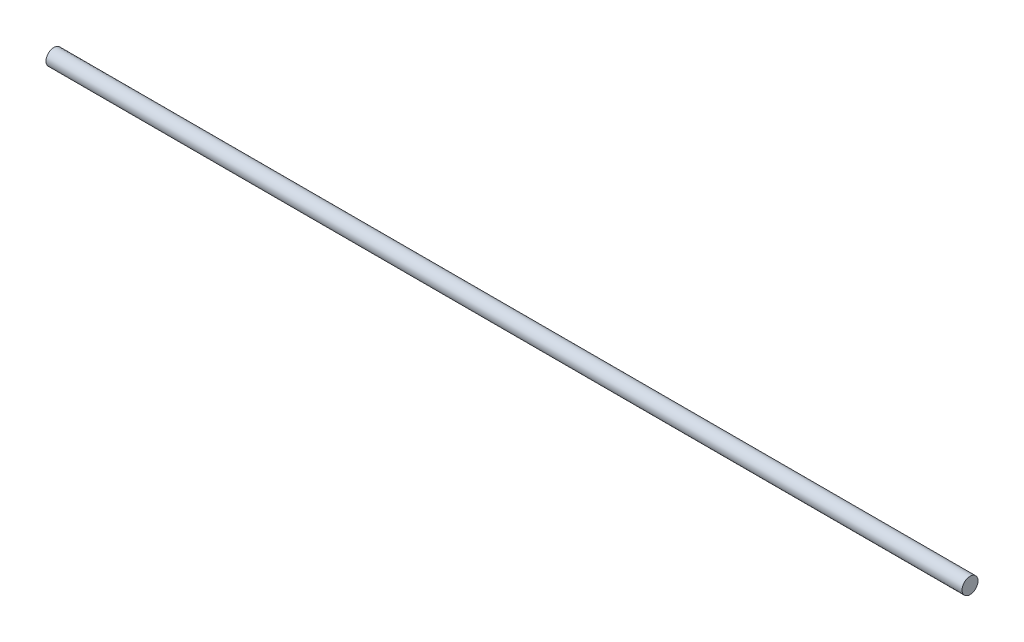
ISO-10303-21;
HEADER;
FILE_DESCRIPTION(('STEP AP214'),'2;1');
FILE_NAME('part.step','',(''),(''),'','','');
FILE_SCHEMA(('AUTOMOTIVE_DESIGN { 1 0 10303 214 1 1 1 1 }'));
ENDSEC;
DATA;
#1=APPLICATION_CONTEXT('core data for automotive mechanical design processes');
#2=APPLICATION_PROTOCOL_DEFINITION('international standard','automotive_design',2000,#1);
#3=PRODUCT_CONTEXT('',#1,'mechanical');
#4=PRODUCT('Part','Part','',(#3));
#5=PRODUCT_RELATED_PRODUCT_CATEGORY('part','',(#4));
#6=PRODUCT_DEFINITION_FORMATION('','',#4);
#7=PRODUCT_DEFINITION_CONTEXT('part definition',#1,'design');
#8=PRODUCT_DEFINITION('design','',#6,#7);
#9=PRODUCT_DEFINITION_SHAPE('','',#8);
#10=(LENGTH_UNIT() NAMED_UNIT(*) SI_UNIT(.MILLI.,.METRE.));
#11=(NAMED_UNIT(*) PLANE_ANGLE_UNIT() SI_UNIT($,.RADIAN.));
#12=(NAMED_UNIT(*) SI_UNIT($,.STERADIAN.) SOLID_ANGLE_UNIT());
#13=UNCERTAINTY_MEASURE_WITH_UNIT(LENGTH_MEASURE(1.E-05),#10,'distance_accuracy_value','');
#14=(GEOMETRIC_REPRESENTATION_CONTEXT(3) GLOBAL_UNCERTAINTY_ASSIGNED_CONTEXT((#13)) GLOBAL_UNIT_ASSIGNED_CONTEXT((#10,
#11,#12)) REPRESENTATION_CONTEXT('',''));
#15=CARTESIAN_POINT('',(0.,0.,0.));
#16=DIRECTION('',(0.,0.,1.));
#17=DIRECTION('',(1.,0.,0.));
#18=AXIS2_PLACEMENT_3D('',#15,#16,#17);
#19=CARTESIAN_POINT('',(460.,0.,0.));
#20=DIRECTION('',(-1.,0.,0.));
#21=DIRECTION('',(0.,0.,1.));
#22=AXIS2_PLACEMENT_3D('',#19,#20,#21);
#23=CYLINDRICAL_SURFACE('',#22,4.);
#24=CARTESIAN_POINT('',(460.,0.,0.));
#25=DIRECTION('',(1.,0.,0.));
#26=DIRECTION('',(0.,0.,-1.));
#27=AXIS2_PLACEMENT_3D('',#24,#25,#26);
#28=CIRCLE('',#27,4.);
#29=CARTESIAN_POINT('',(460.,0.,-4.));
#30=VERTEX_POINT('',#29);
#31=EDGE_CURVE('E10',#30,#30,#28,.T.);
#32=ORIENTED_EDGE('',*,*,#31,.F.);
#33=EDGE_LOOP('',(#32));
#34=FACE_BOUND('',#33,.T.);
#35=CARTESIAN_POINT('',(0.,0.,0.));
#36=DIRECTION('',(1.,0.,0.));
#37=DIRECTION('',(0.,0.,-1.));
#38=AXIS2_PLACEMENT_3D('',#35,#36,#37);
#39=CIRCLE('',#38,4.);
#40=CARTESIAN_POINT('',(0.,0.,-4.));
#41=VERTEX_POINT('',#40);
#42=EDGE_CURVE('E36',#41,#41,#39,.T.);
#43=ORIENTED_EDGE('',*,*,#42,.T.);
#44=EDGE_LOOP('',(#43));
#45=FACE_BOUND('',#44,.T.);
#46=ADVANCED_FACE('F33',(#34,#45),#23,.T.);
#47=CARTESIAN_POINT('',(460.,0.,0.));
#48=DIRECTION('',(1.,0.,0.));
#49=DIRECTION('',(0.,0.,-1.));
#50=AXIS2_PLACEMENT_3D('',#47,#48,#49);
#51=PLANE('',#50);
#52=ORIENTED_EDGE('',*,*,#31,.T.);
#53=EDGE_LOOP('',(#52));
#54=FACE_BOUND('',#53,.T.);
#55=ADVANCED_FACE('F48',(#54),#51,.T.);
#56=CARTESIAN_POINT('',(0.,0.,0.));
#57=DIRECTION('',(1.,0.,0.));
#58=DIRECTION('',(0.,0.,-1.));
#59=AXIS2_PLACEMENT_3D('',#56,#57,#58);
#60=PLANE('',#59);
#61=ORIENTED_EDGE('',*,*,#42,.F.);
#62=EDGE_LOOP('',(#61));
#63=FACE_BOUND('',#62,.T.);
#64=ADVANCED_FACE('F46',(#63),#60,.F.);
#65=CLOSED_SHELL('',(#46,#55,#64));
#66=MANIFOLD_SOLID_BREP('B2',#65);
#67=ADVANCED_BREP_SHAPE_REPRESENTATION('',(#18,#66),#14);
#68=SHAPE_DEFINITION_REPRESENTATION(#9,#67);
ENDSEC;
END-ISO-10303-21;
